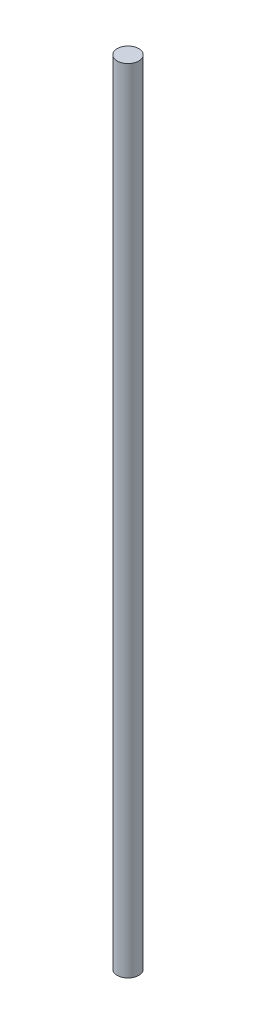
ISO-10303-21;
HEADER;
FILE_DESCRIPTION(('STEP AP214'),'2;1');
FILE_NAME('part.step','',(''),(''),'','','');
FILE_SCHEMA(('AUTOMOTIVE_DESIGN { 1 0 10303 214 1 1 1 1 }'));
ENDSEC;
DATA;
#1=APPLICATION_CONTEXT('core data for automotive mechanical design processes');
#2=APPLICATION_PROTOCOL_DEFINITION('international standard','automotive_design',2000,#1);
#3=PRODUCT_CONTEXT('',#1,'mechanical');
#4=PRODUCT('Part','Part','',(#3));
#5=PRODUCT_RELATED_PRODUCT_CATEGORY('part','',(#4));
#6=PRODUCT_DEFINITION_FORMATION('','',#4);
#7=PRODUCT_DEFINITION_CONTEXT('part definition',#1,'design');
#8=PRODUCT_DEFINITION('design','',#6,#7);
#9=PRODUCT_DEFINITION_SHAPE('','',#8);
#10=(LENGTH_UNIT() NAMED_UNIT(*) SI_UNIT(.MILLI.,.METRE.));
#11=(NAMED_UNIT(*) PLANE_ANGLE_UNIT() SI_UNIT($,.RADIAN.));
#12=(NAMED_UNIT(*) SI_UNIT($,.STERADIAN.) SOLID_ANGLE_UNIT());
#13=UNCERTAINTY_MEASURE_WITH_UNIT(LENGTH_MEASURE(1.E-05),#10,'distance_accuracy_value','');
#14=(GEOMETRIC_REPRESENTATION_CONTEXT(3) GLOBAL_UNCERTAINTY_ASSIGNED_CONTEXT((#13)) GLOBAL_UNIT_ASSIGNED_CONTEXT((#10,
#11,#12)) REPRESENTATION_CONTEXT('',''));
#15=CARTESIAN_POINT('',(0.,0.,0.));
#16=DIRECTION('',(0.,0.,1.));
#17=DIRECTION('',(1.,0.,0.));
#18=AXIS2_PLACEMENT_3D('',#15,#16,#17);
#19=CARTESIAN_POINT('',(0.,350.,0.));
#20=DIRECTION('',(0.,-1.,0.));
#21=DIRECTION('',(0.,0.,-1.));
#22=AXIS2_PLACEMENT_3D('',#19,#20,#21);
#23=PLANE('',#22);
#24=CARTESIAN_POINT('',(0.,350.,0.));
#25=DIRECTION('',(0.,-1.,0.));
#26=DIRECTION('',(0.,0.,-1.));
#27=AXIS2_PLACEMENT_3D('',#24,#25,#26);
#28=CIRCLE('',#27,4.7625);
#29=CARTESIAN_POINT('',(0.,350.,-4.7625));
#30=VERTEX_POINT('',#29);
#31=EDGE_CURVE('E10',#30,#30,#28,.T.);
#32=ORIENTED_EDGE('',*,*,#31,.F.);
#33=EDGE_LOOP('',(#32));
#34=FACE_BOUND('',#33,.T.);
#35=ADVANCED_FACE('F37',(#34),#23,.F.);
#36=CARTESIAN_POINT('',(0.,0.,0.));
#37=DIRECTION('',(0.,-1.,0.));
#38=DIRECTION('',(0.,0.,-1.));
#39=AXIS2_PLACEMENT_3D('',#36,#37,#38);
#40=CYLINDRICAL_SURFACE('',#39,4.7625);
#41=CARTESIAN_POINT('',(0.,-1.11022302462516E-13,0.));
#42=DIRECTION('',(0.,-1.,0.));
#43=DIRECTION('',(0.,0.,-1.));
#44=AXIS2_PLACEMENT_3D('',#41,#42,#43);
#45=CIRCLE('',#44,4.7625);
#46=CARTESIAN_POINT('',(0.,-1.11022302462516E-13,-4.7625));
#47=VERTEX_POINT('',#46);
#48=EDGE_CURVE('E43',#47,#47,#45,.T.);
#49=ORIENTED_EDGE('',*,*,#48,.F.);
#50=EDGE_LOOP('',(#49));
#51=FACE_BOUND('',#50,.T.);
#52=ORIENTED_EDGE('',*,*,#31,.T.);
#53=EDGE_LOOP('',(#52));
#54=FACE_BOUND('',#53,.T.);
#55=ADVANCED_FACE('F51',(#51,#54),#40,.T.);
#56=CARTESIAN_POINT('',(0.,0.,0.));
#57=DIRECTION('',(0.,1.,0.));
#58=DIRECTION('',(0.,0.,1.));
#59=AXIS2_PLACEMENT_3D('',#56,#57,#58);
#60=PLANE('',#59);
#61=ORIENTED_EDGE('',*,*,#48,.T.);
#62=EDGE_LOOP('',(#61));
#63=FACE_BOUND('',#62,.T.);
#64=ADVANCED_FACE('F49',(#63),#60,.F.);
#65=CLOSED_SHELL('',(#35,#55,#64));
#66=MANIFOLD_SOLID_BREP('B2',#65);
#67=ADVANCED_BREP_SHAPE_REPRESENTATION('',(#18,#66),#14);
#68=SHAPE_DEFINITION_REPRESENTATION(#9,#67);
ENDSEC;
END-ISO-10303-21;
